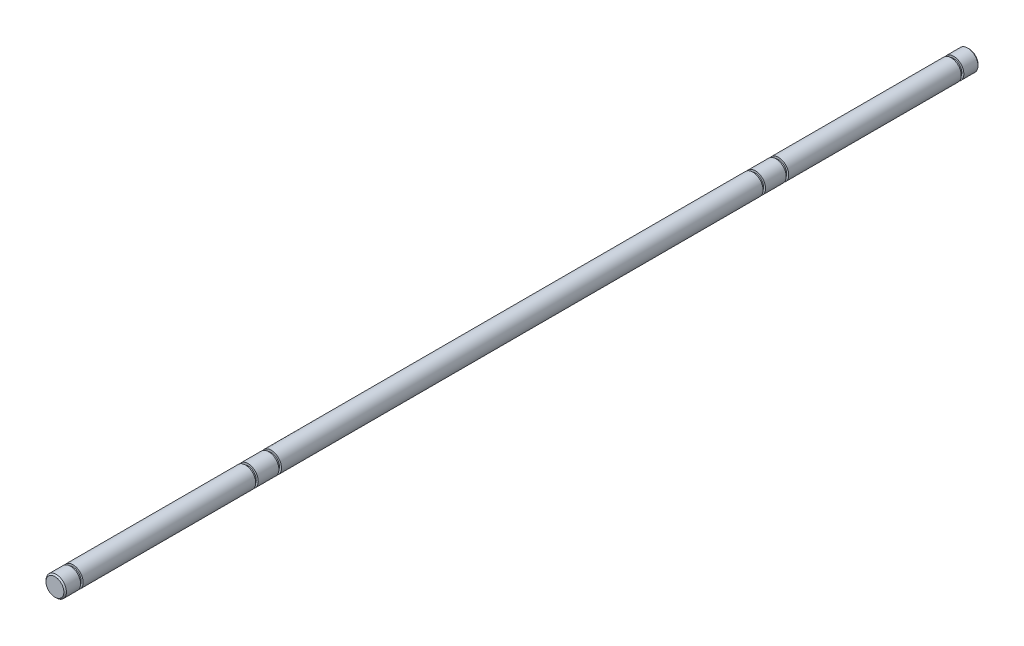
ISO-10303-21;
HEADER;
FILE_DESCRIPTION(('STEP AP214'),'2;1');
FILE_NAME('part.step','',(''),(''),'','','');
FILE_SCHEMA(('AUTOMOTIVE_DESIGN { 1 0 10303 214 1 1 1 1 }'));
ENDSEC;
DATA;
#1=APPLICATION_CONTEXT('core data for automotive mechanical design processes');
#2=APPLICATION_PROTOCOL_DEFINITION('international standard','automotive_design',2000,#1);
#3=PRODUCT_CONTEXT('',#1,'mechanical');
#4=PRODUCT('Part','Part','',(#3));
#5=PRODUCT_RELATED_PRODUCT_CATEGORY('part','',(#4));
#6=PRODUCT_DEFINITION_FORMATION('','',#4);
#7=PRODUCT_DEFINITION_CONTEXT('part definition',#1,'design');
#8=PRODUCT_DEFINITION('design','',#6,#7);
#9=PRODUCT_DEFINITION_SHAPE('','',#8);
#10=(LENGTH_UNIT() NAMED_UNIT(*) SI_UNIT(.MILLI.,.METRE.));
#11=(NAMED_UNIT(*) PLANE_ANGLE_UNIT() SI_UNIT($,.RADIAN.));
#12=(NAMED_UNIT(*) SI_UNIT($,.STERADIAN.) SOLID_ANGLE_UNIT());
#13=UNCERTAINTY_MEASURE_WITH_UNIT(LENGTH_MEASURE(1.E-05),#10,'distance_accuracy_value','');
#14=(GEOMETRIC_REPRESENTATION_CONTEXT(3) GLOBAL_UNCERTAINTY_ASSIGNED_CONTEXT((#13)) GLOBAL_UNIT_ASSIGNED_CONTEXT((#10,
#11,#12)) REPRESENTATION_CONTEXT('',''));
#15=CARTESIAN_POINT('',(0.,0.,0.));
#16=DIRECTION('',(0.,0.,1.));
#17=DIRECTION('',(1.,0.,0.));
#18=AXIS2_PLACEMENT_3D('',#15,#16,#17);
#19=CARTESIAN_POINT('',(0.,3.98999999999999,83.));
#20=DIRECTION('',(0.,0.,1.));
#21=DIRECTION('',(1.,0.,0.));
#22=AXIS2_PLACEMENT_3D('',#19,#20,#21);
#23=PLANE('',#22);
#24=CARTESIAN_POINT('',(0.,0.,83.));
#25=DIRECTION('',(0.,0.,1.));
#26=DIRECTION('',(1.,0.,0.));
#27=AXIS2_PLACEMENT_3D('',#24,#25,#26);
#28=CIRCLE('',#27,3.18999999999999);
#29=CARTESIAN_POINT('',(3.18999999999999,0.,83.));
#30=VERTEX_POINT('',#29);
#31=EDGE_CURVE('E186',#30,#30,#28,.T.);
#32=ORIENTED_EDGE('',*,*,#31,.F.);
#33=EDGE_LOOP('',(#32));
#34=FACE_BOUND('',#33,.T.);
#35=CARTESIAN_POINT('',(0.,0.,83.));
#36=DIRECTION('',(0.,0.,1.));
#37=DIRECTION('',(1.,0.,0.));
#38=AXIS2_PLACEMENT_3D('',#35,#36,#37);
#39=CIRCLE('',#38,3.97);
#40=CARTESIAN_POINT('',(3.97,0.,83.));
#41=VERTEX_POINT('',#40);
#42=EDGE_CURVE('E170',#41,#41,#39,.T.);
#43=ORIENTED_EDGE('',*,*,#42,.T.);
#44=EDGE_LOOP('',(#43));
#45=FACE_BOUND('',#44,.T.);
#46=ADVANCED_FACE('F149',(#34,#45),#23,.T.);
#47=CARTESIAN_POINT('',(0.,3.98999999999999,272.));
#48=DIRECTION('',(0.,0.,-1.));
#49=DIRECTION('',(1.,0.,0.));
#50=AXIS2_PLACEMENT_3D('',#47,#48,#49);
#51=PLANE('',#50);
#52=CARTESIAN_POINT('',(0.,0.,272.));
#53=DIRECTION('',(0.,0.,1.));
#54=DIRECTION('',(1.,0.,0.));
#55=AXIS2_PLACEMENT_3D('',#52,#53,#54);
#56=CIRCLE('',#55,3.18999999999999);
#57=CARTESIAN_POINT('',(3.18999999999999,0.,272.));
#58=VERTEX_POINT('',#57);
#59=EDGE_CURVE('E207',#58,#58,#56,.T.);
#60=ORIENTED_EDGE('',*,*,#59,.T.);
#61=EDGE_LOOP('',(#60));
#62=FACE_BOUND('',#61,.T.);
#63=CARTESIAN_POINT('',(0.,0.,272.));
#64=DIRECTION('',(0.,0.,-1.));
#65=DIRECTION('',(-1.,0.,0.));
#66=AXIS2_PLACEMENT_3D('',#63,#64,#65);
#67=CIRCLE('',#66,3.96875);
#68=CARTESIAN_POINT('',(-3.96875,0.,272.));
#69=VERTEX_POINT('',#68);
#70=EDGE_CURVE('E202',#69,#69,#67,.T.);
#71=ORIENTED_EDGE('',*,*,#70,.T.);
#72=EDGE_LOOP('',(#71));
#73=FACE_BOUND('',#72,.T.);
#74=ADVANCED_FACE('F272',(#62,#73),#51,.T.);
#75=CARTESIAN_POINT('',(0.,0.,355.));
#76=DIRECTION('',(0.,0.,-1.));
#77=DIRECTION('',(-1.,0.,0.));
#78=AXIS2_PLACEMENT_3D('',#75,#76,#77);
#79=CYLINDRICAL_SURFACE('',#78,3.99);
#80=CARTESIAN_POINT('',(0.,0.,84.));
#81=DIRECTION('',(0.,0.,1.));
#82=DIRECTION('',(1.,0.,0.));
#83=AXIS2_PLACEMENT_3D('',#80,#81,#82);
#84=CIRCLE('',#83,3.98999999999999);
#85=CARTESIAN_POINT('',(3.98999999999999,0.,84.));
#86=VERTEX_POINT('',#85);
#87=EDGE_CURVE('E182',#86,#86,#84,.T.);
#88=ORIENTED_EDGE('',*,*,#87,.T.);
#89=EDGE_LOOP('',(#88));
#90=FACE_BOUND('',#89,.T.);
#91=CARTESIAN_POINT('',(0.,0.,271.));
#92=DIRECTION('',(0.,0.,1.));
#93=DIRECTION('',(1.,0.,0.));
#94=AXIS2_PLACEMENT_3D('',#91,#92,#93);
#95=CIRCLE('',#94,3.98999999999999);
#96=CARTESIAN_POINT('',(3.98999999999999,0.,271.));
#97=VERTEX_POINT('',#96);
#98=EDGE_CURVE('E203',#97,#97,#95,.T.);
#99=ORIENTED_EDGE('',*,*,#98,.F.);
#100=EDGE_LOOP('',(#99));
#101=FACE_BOUND('',#100,.T.);
#102=ADVANCED_FACE('F278',(#90,#101),#79,.T.);
#103=CARTESIAN_POINT('',(0.,3.98999999999999,84.));
#104=DIRECTION('',(0.,0.,-1.));
#105=DIRECTION('',(-1.,0.,0.));
#106=AXIS2_PLACEMENT_3D('',#103,#104,#105);
#107=PLANE('',#106);
#108=ORIENTED_EDGE('',*,*,#87,.F.);
#109=EDGE_LOOP('',(#108));
#110=FACE_BOUND('',#109,.T.);
#111=CARTESIAN_POINT('',(0.,0.,84.));
#112=DIRECTION('',(0.,0.,1.));
#113=DIRECTION('',(1.,0.,0.));
#114=AXIS2_PLACEMENT_3D('',#111,#112,#113);
#115=CIRCLE('',#114,3.18999999999999);
#116=CARTESIAN_POINT('',(3.18999999999999,0.,84.));
#117=VERTEX_POINT('',#116);
#118=EDGE_CURVE('E177',#117,#117,#115,.T.);
#119=ORIENTED_EDGE('',*,*,#118,.T.);
#120=EDGE_LOOP('',(#119));
#121=FACE_BOUND('',#120,.T.);
#122=ADVANCED_FACE('F286',(#110,#121),#107,.T.);
#123=CARTESIAN_POINT('',(0.,0.,355.));
#124=DIRECTION('',(0.,0.,1.));
#125=DIRECTION('',(1.,0.,0.));
#126=AXIS2_PLACEMENT_3D('',#123,#124,#125);
#127=CYLINDRICAL_SURFACE('',#126,3.18999999999999);
#128=ORIENTED_EDGE('',*,*,#31,.T.);
#129=EDGE_LOOP('',(#128));
#130=FACE_BOUND('',#129,.T.);
#131=ORIENTED_EDGE('',*,*,#118,.F.);
#132=EDGE_LOOP('',(#131));
#133=FACE_BOUND('',#132,.T.);
#134=ADVANCED_FACE('F285',(#130,#133),#127,.T.);
#135=CARTESIAN_POINT('',(0.,3.98999999999999,271.));
#136=DIRECTION('',(0.,0.,1.));
#137=DIRECTION('',(-1.,0.,0.));
#138=AXIS2_PLACEMENT_3D('',#135,#136,#137);
#139=PLANE('',#138);
#140=ORIENTED_EDGE('',*,*,#98,.T.);
#141=EDGE_LOOP('',(#140));
#142=FACE_BOUND('',#141,.T.);
#143=CARTESIAN_POINT('',(0.,0.,271.));
#144=DIRECTION('',(0.,0.,1.));
#145=DIRECTION('',(1.,0.,0.));
#146=AXIS2_PLACEMENT_3D('',#143,#144,#145);
#147=CIRCLE('',#146,3.18999999999999);
#148=CARTESIAN_POINT('',(3.18999999999999,0.,271.));
#149=VERTEX_POINT('',#148);
#150=EDGE_CURVE('E198',#149,#149,#147,.T.);
#151=ORIENTED_EDGE('',*,*,#150,.F.);
#152=EDGE_LOOP('',(#151));
#153=FACE_BOUND('',#152,.T.);
#154=ADVANCED_FACE('F341',(#142,#153),#139,.T.);
#155=CARTESIAN_POINT('',(0.,0.,0.));
#156=DIRECTION('',(0.,0.,-1.));
#157=DIRECTION('',(1.,0.,0.));
#158=AXIS2_PLACEMENT_3D('',#155,#156,#157);
#159=CYLINDRICAL_SURFACE('',#158,3.18999999999999);
#160=ORIENTED_EDGE('',*,*,#59,.F.);
#161=EDGE_LOOP('',(#160));
#162=FACE_BOUND('',#161,.T.);
#163=ORIENTED_EDGE('',*,*,#150,.T.);
#164=EDGE_LOOP('',(#163));
#165=FACE_BOUND('',#164,.T.);
#166=ADVANCED_FACE('F343',(#162,#165),#159,.T.);
#167=CARTESIAN_POINT('',(0.,0.,259.714575772263));
#168=DIRECTION('',(0.,0.,1.));
#169=DIRECTION('',(1.,0.,0.));
#170=AXIS2_PLACEMENT_3D('',#167,#168,#169);
#171=CYLINDRICAL_SURFACE('',#170,3.96875);
#172=ORIENTED_EDGE('',*,*,#70,.F.);
#173=EDGE_LOOP('',(#172));
#174=FACE_BOUND('',#173,.T.);
#175=CARTESIAN_POINT('',(0.,0.,280.));
#176=DIRECTION('',(0.,0.,1.));
#177=DIRECTION('',(1.,0.,0.));
#178=AXIS2_PLACEMENT_3D('',#175,#176,#177);
#179=CIRCLE('',#178,3.96875);
#180=CARTESIAN_POINT('',(3.96875,0.,280.));
#181=VERTEX_POINT('',#180);
#182=EDGE_CURVE('E218',#181,#181,#179,.T.);
#183=ORIENTED_EDGE('',*,*,#182,.F.);
#184=EDGE_LOOP('',(#183));
#185=FACE_BOUND('',#184,.T.);
#186=ADVANCED_FACE('F331',(#174,#185),#171,.T.);
#187=CARTESIAN_POINT('',(0.,3.98999999999999,280.));
#188=DIRECTION('',(0.,0.,1.));
#189=DIRECTION('',(-1.,0.,0.));
#190=AXIS2_PLACEMENT_3D('',#187,#188,#189);
#191=PLANE('',#190);
#192=CARTESIAN_POINT('',(0.,0.,280.));
#193=DIRECTION('',(0.,0.,1.));
#194=DIRECTION('',(1.,0.,0.));
#195=AXIS2_PLACEMENT_3D('',#192,#193,#194);
#196=CIRCLE('',#195,3.18999999999999);
#197=CARTESIAN_POINT('',(3.18999999999999,0.,280.));
#198=VERTEX_POINT('',#197);
#199=EDGE_CURVE('E199',#198,#198,#196,.T.);
#200=ORIENTED_EDGE('',*,*,#199,.F.);
#201=EDGE_LOOP('',(#200));
#202=FACE_BOUND('',#201,.T.);
#203=ORIENTED_EDGE('',*,*,#182,.T.);
#204=EDGE_LOOP('',(#203));
#205=FACE_BOUND('',#204,.T.);
#206=ADVANCED_FACE('F327',(#202,#205),#191,.T.);
#207=CARTESIAN_POINT('',(0.,0.,0.));
#208=DIRECTION('',(0.,0.,-1.));
#209=DIRECTION('',(1.,0.,0.));
#210=AXIS2_PLACEMENT_3D('',#207,#208,#209);
#211=CYLINDRICAL_SURFACE('',#210,3.18999999999999);
#212=CARTESIAN_POINT('',(0.,0.,281.));
#213=DIRECTION('',(0.,0.,1.));
#214=DIRECTION('',(1.,0.,0.));
#215=AXIS2_PLACEMENT_3D('',#212,#213,#214);
#216=CIRCLE('',#215,3.18999999999999);
#217=CARTESIAN_POINT('',(3.18999999999999,0.,281.));
#218=VERTEX_POINT('',#217);
#219=EDGE_CURVE('E195',#218,#218,#216,.T.);
#220=ORIENTED_EDGE('',*,*,#219,.F.);
#221=EDGE_LOOP('',(#220));
#222=FACE_BOUND('',#221,.T.);
#223=ORIENTED_EDGE('',*,*,#199,.T.);
#224=EDGE_LOOP('',(#223));
#225=FACE_BOUND('',#224,.T.);
#226=ADVANCED_FACE('F330',(#222,#225),#211,.T.);
#227=CARTESIAN_POINT('',(0.,3.98999999999999,281.));
#228=DIRECTION('',(0.,0.,-1.));
#229=DIRECTION('',(1.,0.,0.));
#230=AXIS2_PLACEMENT_3D('',#227,#228,#229);
#231=PLANE('',#230);
#232=ORIENTED_EDGE('',*,*,#219,.T.);
#233=EDGE_LOOP('',(#232));
#234=FACE_BOUND('',#233,.T.);
#235=CARTESIAN_POINT('',(0.,0.,281.));
#236=DIRECTION('',(0.,0.,-1.));
#237=DIRECTION('',(-1.,0.,0.));
#238=AXIS2_PLACEMENT_3D('',#235,#236,#237);
#239=CIRCLE('',#238,3.96875);
#240=CARTESIAN_POINT('',(-3.96875,0.,281.));
#241=VERTEX_POINT('',#240);
#242=EDGE_CURVE('E221',#241,#241,#239,.T.);
#243=ORIENTED_EDGE('',*,*,#242,.T.);
#244=EDGE_LOOP('',(#243));
#245=FACE_BOUND('',#244,.T.);
#246=ADVANCED_FACE('F333',(#234,#245),#231,.T.);
#247=ORIENTED_EDGE('',*,*,#242,.F.);
#248=EDGE_LOOP('',(#247));
#249=FACE_BOUND('',#248,.T.);
#250=CARTESIAN_POINT('',(0.,0.,348.));
#251=DIRECTION('',(0.,0.,1.));
#252=DIRECTION('',(1.,0.,0.));
#253=AXIS2_PLACEMENT_3D('',#250,#251,#252);
#254=CIRCLE('',#253,3.96875);
#255=CARTESIAN_POINT('',(3.96875,0.,348.));
#256=VERTEX_POINT('',#255);
#257=EDGE_CURVE('E224',#256,#256,#254,.T.);
#258=ORIENTED_EDGE('',*,*,#257,.F.);
#259=EDGE_LOOP('',(#258));
#260=FACE_BOUND('',#259,.T.);
#261=ADVANCED_FACE('F336',(#249,#260),#171,.T.);
#262=CARTESIAN_POINT('',(0.,3.99,348.));
#263=DIRECTION('',(0.,0.,1.));
#264=DIRECTION('',(-1.,0.,0.));
#265=AXIS2_PLACEMENT_3D('',#262,#263,#264);
#266=PLANE('',#265);
#267=CARTESIAN_POINT('',(0.,0.,348.));
#268=DIRECTION('',(0.,0.,1.));
#269=DIRECTION('',(1.,0.,0.));
#270=AXIS2_PLACEMENT_3D('',#267,#268,#269);
#271=CIRCLE('',#270,3.19);
#272=CARTESIAN_POINT('',(3.19,0.,348.));
#273=VERTEX_POINT('',#272);
#274=EDGE_CURVE('E206',#273,#273,#271,.T.);
#275=ORIENTED_EDGE('',*,*,#274,.F.);
#276=EDGE_LOOP('',(#275));
#277=FACE_BOUND('',#276,.T.);
#278=ORIENTED_EDGE('',*,*,#257,.T.);
#279=EDGE_LOOP('',(#278));
#280=FACE_BOUND('',#279,.T.);
#281=ADVANCED_FACE('F349',(#277,#280),#266,.T.);
#282=CARTESIAN_POINT('',(0.,0.,0.));
#283=DIRECTION('',(0.,0.,-1.));
#284=DIRECTION('',(1.,0.,0.));
#285=AXIS2_PLACEMENT_3D('',#282,#283,#284);
#286=CYLINDRICAL_SURFACE('',#285,3.19);
#287=CARTESIAN_POINT('',(0.,0.,349.));
#288=DIRECTION('',(0.,0.,1.));
#289=DIRECTION('',(1.,0.,0.));
#290=AXIS2_PLACEMENT_3D('',#287,#288,#289);
#291=CIRCLE('',#290,3.19);
#292=CARTESIAN_POINT('',(3.19,0.,349.));
#293=VERTEX_POINT('',#292);
#294=EDGE_CURVE('E181',#293,#293,#291,.T.);
#295=ORIENTED_EDGE('',*,*,#294,.F.);
#296=EDGE_LOOP('',(#295));
#297=FACE_BOUND('',#296,.T.);
#298=ORIENTED_EDGE('',*,*,#274,.T.);
#299=EDGE_LOOP('',(#298));
#300=FACE_BOUND('',#299,.T.);
#301=ADVANCED_FACE('F352',(#297,#300),#286,.T.);
#302=CARTESIAN_POINT('',(0.,3.99,349.));
#303=DIRECTION('',(0.,0.,-1.));
#304=DIRECTION('',(1.,0.,0.));
#305=AXIS2_PLACEMENT_3D('',#302,#303,#304);
#306=PLANE('',#305);
#307=ORIENTED_EDGE('',*,*,#294,.T.);
#308=EDGE_LOOP('',(#307));
#309=FACE_BOUND('',#308,.T.);
#310=CARTESIAN_POINT('',(0.,0.,349.));
#311=DIRECTION('',(0.,0.,-1.));
#312=DIRECTION('',(-1.,0.,0.));
#313=AXIS2_PLACEMENT_3D('',#310,#311,#312);
#314=CIRCLE('',#313,3.96875);
#315=CARTESIAN_POINT('',(-3.96875,0.,349.));
#316=VERTEX_POINT('',#315);
#317=EDGE_CURVE('E227',#316,#316,#314,.T.);
#318=ORIENTED_EDGE('',*,*,#317,.T.);
#319=EDGE_LOOP('',(#318));
#320=FACE_BOUND('',#319,.T.);
#321=ADVANCED_FACE('F354',(#309,#320),#306,.T.);
#322=CARTESIAN_POINT('',(0.,0.,354.5));
#323=DIRECTION('',(0.,0.,1.));
#324=DIRECTION('',(1.,0.,0.));
#325=AXIS2_PLACEMENT_3D('',#322,#323,#324);
#326=CIRCLE('',#325,3.96875);
#327=CARTESIAN_POINT('',(3.96875,0.,354.5));
#328=VERTEX_POINT('',#327);
#329=EDGE_CURVE('E11',#328,#328,#326,.F.);
#330=ORIENTED_EDGE('',*,*,#329,.T.);
#331=EDGE_LOOP('',(#330));
#332=FACE_BOUND('',#331,.T.);
#333=ORIENTED_EDGE('',*,*,#317,.F.);
#334=EDGE_LOOP('',(#333));
#335=FACE_BOUND('',#334,.T.);
#336=ADVANCED_FACE('F298',(#332,#335),#171,.T.);
#337=CARTESIAN_POINT('',(0.,0.,355.));
#338=DIRECTION('',(0.,0.,1.));
#339=DIRECTION('',(1.,0.,0.));
#340=AXIS2_PLACEMENT_3D('',#337,#338,#339);
#341=PLANE('',#340);
#342=CARTESIAN_POINT('',(0.,0.,355.));
#343=DIRECTION('',(0.,0.,1.));
#344=DIRECTION('',(1.,0.,0.));
#345=AXIS2_PLACEMENT_3D('',#342,#343,#344);
#346=CIRCLE('',#345,3.46875000000013);
#347=CARTESIAN_POINT('',(3.46875000000013,0.,355.));
#348=VERTEX_POINT('',#347);
#349=EDGE_CURVE('E156',#348,#348,#346,.T.);
#350=ORIENTED_EDGE('',*,*,#349,.T.);
#351=EDGE_LOOP('',(#350));
#352=FACE_BOUND('',#351,.T.);
#353=ADVANCED_FACE('F265',(#352),#341,.T.);
#354=CARTESIAN_POINT('',(0.,0.,95.2854242277373));
#355=DIRECTION('',(0.,0.,-1.));
#356=DIRECTION('',(-1.,0.,0.));
#357=AXIS2_PLACEMENT_3D('',#354,#355,#356);
#358=CYLINDRICAL_SURFACE('',#357,3.97);
#359=CARTESIAN_POINT('',(0.,0.,75.));
#360=DIRECTION('',(0.,0.,-1.));
#361=DIRECTION('',(-1.,0.,0.));
#362=AXIS2_PLACEMENT_3D('',#359,#360,#361);
#363=CIRCLE('',#362,3.97);
#364=CARTESIAN_POINT('',(-3.97,0.,75.));
#365=VERTEX_POINT('',#364);
#366=EDGE_CURVE('E236',#365,#365,#363,.T.);
#367=ORIENTED_EDGE('',*,*,#366,.F.);
#368=EDGE_LOOP('',(#367));
#369=FACE_BOUND('',#368,.T.);
#370=ORIENTED_EDGE('',*,*,#42,.F.);
#371=EDGE_LOOP('',(#370));
#372=FACE_BOUND('',#371,.T.);
#373=ADVANCED_FACE('F249',(#369,#372),#358,.T.);
#374=CARTESIAN_POINT('',(0.,3.98999999999999,75.));
#375=DIRECTION('',(0.,0.,-1.));
#376=DIRECTION('',(-1.,0.,0.));
#377=AXIS2_PLACEMENT_3D('',#374,#375,#376);
#378=PLANE('',#377);
#379=CARTESIAN_POINT('',(0.,0.,75.));
#380=DIRECTION('',(0.,0.,1.));
#381=DIRECTION('',(1.,0.,0.));
#382=AXIS2_PLACEMENT_3D('',#379,#380,#381);
#383=CIRCLE('',#382,3.18999999999999);
#384=CARTESIAN_POINT('',(3.18999999999999,0.,75.));
#385=VERTEX_POINT('',#384);
#386=EDGE_CURVE('E178',#385,#385,#383,.T.);
#387=ORIENTED_EDGE('',*,*,#386,.T.);
#388=EDGE_LOOP('',(#387));
#389=FACE_BOUND('',#388,.T.);
#390=ORIENTED_EDGE('',*,*,#366,.T.);
#391=EDGE_LOOP('',(#390));
#392=FACE_BOUND('',#391,.T.);
#393=ADVANCED_FACE('F264',(#389,#392),#378,.T.);
#394=CARTESIAN_POINT('',(0.,0.,355.));
#395=DIRECTION('',(0.,0.,1.));
#396=DIRECTION('',(1.,0.,0.));
#397=AXIS2_PLACEMENT_3D('',#394,#395,#396);
#398=CYLINDRICAL_SURFACE('',#397,3.18999999999999);
#399=CARTESIAN_POINT('',(0.,0.,74.));
#400=DIRECTION('',(0.,0.,1.));
#401=DIRECTION('',(1.,0.,0.));
#402=AXIS2_PLACEMENT_3D('',#399,#400,#401);
#403=CIRCLE('',#402,3.18999999999999);
#404=CARTESIAN_POINT('',(3.18999999999999,0.,74.));
#405=VERTEX_POINT('',#404);
#406=EDGE_CURVE('E174',#405,#405,#403,.T.);
#407=ORIENTED_EDGE('',*,*,#406,.T.);
#408=EDGE_LOOP('',(#407));
#409=FACE_BOUND('',#408,.T.);
#410=ORIENTED_EDGE('',*,*,#386,.F.);
#411=EDGE_LOOP('',(#410));
#412=FACE_BOUND('',#411,.T.);
#413=ADVANCED_FACE('F258',(#409,#412),#398,.T.);
#414=CARTESIAN_POINT('',(0.,3.98999999999999,74.));
#415=DIRECTION('',(0.,0.,1.));
#416=DIRECTION('',(1.,0.,0.));
#417=AXIS2_PLACEMENT_3D('',#414,#415,#416);
#418=PLANE('',#417);
#419=ORIENTED_EDGE('',*,*,#406,.F.);
#420=EDGE_LOOP('',(#419));
#421=FACE_BOUND('',#420,.T.);
#422=CARTESIAN_POINT('',(0.,0.,74.));
#423=DIRECTION('',(0.,0.,1.));
#424=DIRECTION('',(1.,0.,0.));
#425=AXIS2_PLACEMENT_3D('',#422,#423,#424);
#426=CIRCLE('',#425,3.97);
#427=CARTESIAN_POINT('',(3.97,0.,74.));
#428=VERTEX_POINT('',#427);
#429=EDGE_CURVE('E173',#428,#428,#426,.T.);
#430=ORIENTED_EDGE('',*,*,#429,.T.);
#431=EDGE_LOOP('',(#430));
#432=FACE_BOUND('',#431,.T.);
#433=ADVANCED_FACE('F242',(#421,#432),#418,.T.);
#434=CARTESIAN_POINT('',(0.,0.,7.00000000000001));
#435=DIRECTION('',(0.,0.,-1.));
#436=DIRECTION('',(-1.,0.,0.));
#437=AXIS2_PLACEMENT_3D('',#434,#435,#436);
#438=CIRCLE('',#437,3.97);
#439=CARTESIAN_POINT('',(-3.97,0.,7.00000000000001));
#440=VERTEX_POINT('',#439);
#441=EDGE_CURVE('E230',#440,#440,#438,.T.);
#442=ORIENTED_EDGE('',*,*,#441,.F.);
#443=EDGE_LOOP('',(#442));
#444=FACE_BOUND('',#443,.T.);
#445=ORIENTED_EDGE('',*,*,#429,.F.);
#446=EDGE_LOOP('',(#445));
#447=FACE_BOUND('',#446,.T.);
#448=ADVANCED_FACE('F244',(#444,#447),#358,.T.);
#449=CARTESIAN_POINT('',(0.,3.99,7.));
#450=DIRECTION('',(0.,0.,-1.));
#451=DIRECTION('',(-1.,0.,0.));
#452=AXIS2_PLACEMENT_3D('',#449,#450,#451);
#453=PLANE('',#452);
#454=CARTESIAN_POINT('',(0.,0.,7.00000000000001));
#455=DIRECTION('',(0.,0.,1.));
#456=DIRECTION('',(1.,0.,0.));
#457=AXIS2_PLACEMENT_3D('',#454,#455,#456);
#458=CIRCLE('',#457,3.19);
#459=CARTESIAN_POINT('',(3.19,0.,7.00000000000001));
#460=VERTEX_POINT('',#459);
#461=EDGE_CURVE('E185',#460,#460,#458,.T.);
#462=ORIENTED_EDGE('',*,*,#461,.T.);
#463=EDGE_LOOP('',(#462));
#464=FACE_BOUND('',#463,.T.);
#465=ORIENTED_EDGE('',*,*,#441,.T.);
#466=EDGE_LOOP('',(#465));
#467=FACE_BOUND('',#466,.T.);
#468=ADVANCED_FACE('F246',(#464,#467),#453,.T.);
#469=CARTESIAN_POINT('',(0.,0.,355.));
#470=DIRECTION('',(0.,0.,1.));
#471=DIRECTION('',(1.,0.,0.));
#472=AXIS2_PLACEMENT_3D('',#469,#470,#471);
#473=CYLINDRICAL_SURFACE('',#472,3.19);
#474=CARTESIAN_POINT('',(0.,0.,6.00000000000001));
#475=DIRECTION('',(0.,0.,1.));
#476=DIRECTION('',(1.,0.,0.));
#477=AXIS2_PLACEMENT_3D('',#474,#475,#476);
#478=CIRCLE('',#477,3.19);
#479=CARTESIAN_POINT('',(3.19,0.,6.00000000000001));
#480=VERTEX_POINT('',#479);
#481=EDGE_CURVE('E169',#480,#480,#478,.T.);
#482=ORIENTED_EDGE('',*,*,#481,.T.);
#483=EDGE_LOOP('',(#482));
#484=FACE_BOUND('',#483,.T.);
#485=ORIENTED_EDGE('',*,*,#461,.F.);
#486=EDGE_LOOP('',(#485));
#487=FACE_BOUND('',#486,.T.);
#488=ADVANCED_FACE('F255',(#484,#487),#473,.T.);
#489=CARTESIAN_POINT('',(0.,3.99,6.));
#490=DIRECTION('',(0.,0.,1.));
#491=DIRECTION('',(1.,0.,0.));
#492=AXIS2_PLACEMENT_3D('',#489,#490,#491);
#493=PLANE('',#492);
#494=ORIENTED_EDGE('',*,*,#481,.F.);
#495=EDGE_LOOP('',(#494));
#496=FACE_BOUND('',#495,.T.);
#497=CARTESIAN_POINT('',(0.,0.,6.00000000000001));
#498=DIRECTION('',(0.,0.,1.));
#499=DIRECTION('',(1.,0.,0.));
#500=AXIS2_PLACEMENT_3D('',#497,#498,#499);
#501=CIRCLE('',#500,3.97);
#502=CARTESIAN_POINT('',(3.97,0.,6.00000000000001));
#503=VERTEX_POINT('',#502);
#504=EDGE_CURVE('E233',#503,#503,#501,.T.);
#505=ORIENTED_EDGE('',*,*,#504,.T.);
#506=EDGE_LOOP('',(#505));
#507=FACE_BOUND('',#506,.T.);
#508=ADVANCED_FACE('F269',(#496,#507),#493,.T.);
#509=CARTESIAN_POINT('',(0.,0.,0.49999999999982));
#510=DIRECTION('',(0.,0.,1.));
#511=DIRECTION('',(1.,0.,0.));
#512=AXIS2_PLACEMENT_3D('',#509,#510,#511);
#513=CIRCLE('',#512,3.97);
#514=CARTESIAN_POINT('',(3.97,0.,0.49999999999982));
#515=VERTEX_POINT('',#514);
#516=EDGE_CURVE('E160',#515,#515,#513,.T.);
#517=ORIENTED_EDGE('',*,*,#516,.T.);
#518=EDGE_LOOP('',(#517));
#519=FACE_BOUND('',#518,.T.);
#520=ORIENTED_EDGE('',*,*,#504,.F.);
#521=EDGE_LOOP('',(#520));
#522=FACE_BOUND('',#521,.T.);
#523=ADVANCED_FACE('F250',(#519,#522),#358,.T.);
#524=CARTESIAN_POINT('',(0.,0.,0.));
#525=DIRECTION('',(0.,0.,1.));
#526=DIRECTION('',(1.,0.,0.));
#527=AXIS2_PLACEMENT_3D('',#524,#525,#526);
#528=PLANE('',#527);
#529=CARTESIAN_POINT('',(0.,0.,0.));
#530=DIRECTION('',(0.,0.,1.));
#531=DIRECTION('',(1.,0.,0.));
#532=AXIS2_PLACEMENT_3D('',#529,#530,#531);
#533=CIRCLE('',#532,3.47000000000019);
#534=CARTESIAN_POINT('',(3.47000000000019,0.,0.));
#535=VERTEX_POINT('',#534);
#536=EDGE_CURVE('E164',#535,#535,#533,.F.);
#537=ORIENTED_EDGE('',*,*,#536,.T.);
#538=EDGE_LOOP('',(#537));
#539=FACE_BOUND('',#538,.T.);
#540=ADVANCED_FACE('F268',(#539),#528,.F.);
#541=CARTESIAN_POINT('',(0.,0.,0.));
#542=DIRECTION('',(0.,0.,1.));
#543=DIRECTION('',(1.,0.,0.));
#544=AXIS2_PLACEMENT_3D('',#541,#542,#543);
#545=CONICAL_SURFACE('',#544,3.47000000000019,0.785398163397434);
#546=ORIENTED_EDGE('',*,*,#516,.F.);
#547=EDGE_LOOP('',(#546));
#548=FACE_BOUND('',#547,.T.);
#549=ORIENTED_EDGE('',*,*,#536,.F.);
#550=EDGE_LOOP('',(#549));
#551=FACE_BOUND('',#550,.T.);
#552=ADVANCED_FACE('F301',(#548,#551),#545,.T.);
#553=CARTESIAN_POINT('',(0.,0.,355.));
#554=DIRECTION('',(0.,0.,-1.));
#555=DIRECTION('',(-1.,0.,0.));
#556=AXIS2_PLACEMENT_3D('',#553,#554,#555);
#557=CONICAL_SURFACE('',#556,3.46875000000013,0.785398163397484);
#558=ORIENTED_EDGE('',*,*,#329,.F.);
#559=EDGE_LOOP('',(#558));
#560=FACE_BOUND('',#559,.T.);
#561=ORIENTED_EDGE('',*,*,#349,.F.);
#562=EDGE_LOOP('',(#561));
#563=FACE_BOUND('',#562,.T.);
#564=ADVANCED_FACE('F151',(#560,#563),#557,.T.);
#565=CLOSED_SHELL('',(#46,#74,#102,#122,#134,#154,#166,#186,#206,#226,#246,#261,#281,#301,#321,
#336,#353,#373,#393,#413,#433,#448,#468,#488,#508,#523,#540,#552,#564));
#566=MANIFOLD_SOLID_BREP('B2',#565);
#567=ADVANCED_BREP_SHAPE_REPRESENTATION('',(#18,#566),#14);
#568=SHAPE_DEFINITION_REPRESENTATION(#9,#567);
ENDSEC;
END-ISO-10303-21;
